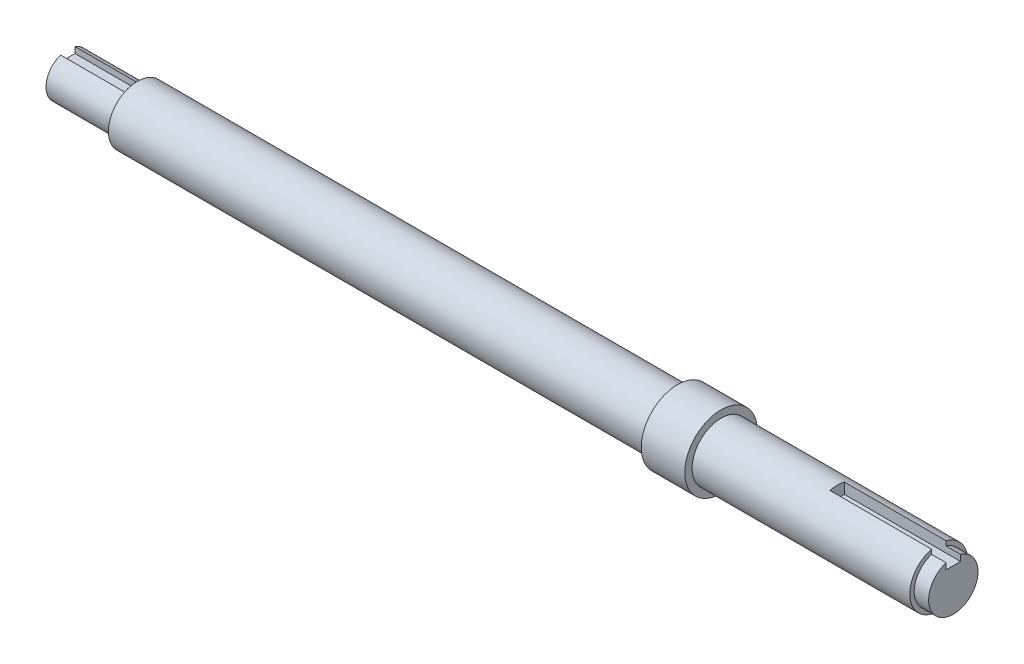
ISO-10303-21;
HEADER;
FILE_DESCRIPTION(('STEP AP214'),'2;1');
FILE_NAME('part.step','',(''),(''),'','','');
FILE_SCHEMA(('AUTOMOTIVE_DESIGN { 1 0 10303 214 1 1 1 1 }'));
ENDSEC;
DATA;
#1=APPLICATION_CONTEXT('core data for automotive mechanical design processes');
#2=APPLICATION_PROTOCOL_DEFINITION('international standard','automotive_design',2000,#1);
#3=PRODUCT_CONTEXT('',#1,'mechanical');
#4=PRODUCT('Part','Part','',(#3));
#5=PRODUCT_RELATED_PRODUCT_CATEGORY('part','',(#4));
#6=PRODUCT_DEFINITION_FORMATION('','',#4);
#7=PRODUCT_DEFINITION_CONTEXT('part definition',#1,'design');
#8=PRODUCT_DEFINITION('design','',#6,#7);
#9=PRODUCT_DEFINITION_SHAPE('','',#8);
#10=(LENGTH_UNIT() NAMED_UNIT(*) SI_UNIT(.MILLI.,.METRE.));
#11=(NAMED_UNIT(*) PLANE_ANGLE_UNIT() SI_UNIT($,.RADIAN.));
#12=(NAMED_UNIT(*) SI_UNIT($,.STERADIAN.) SOLID_ANGLE_UNIT());
#13=UNCERTAINTY_MEASURE_WITH_UNIT(LENGTH_MEASURE(1.E-05),#10,'distance_accuracy_value','');
#14=(GEOMETRIC_REPRESENTATION_CONTEXT(3) GLOBAL_UNCERTAINTY_ASSIGNED_CONTEXT((#13)) GLOBAL_UNIT_ASSIGNED_CONTEXT((#10,
#11,#12)) REPRESENTATION_CONTEXT('',''));
#15=CARTESIAN_POINT('',(0.,0.,0.));
#16=DIRECTION('',(0.,0.,1.));
#17=DIRECTION('',(1.,0.,0.));
#18=AXIS2_PLACEMENT_3D('',#15,#16,#17);
#19=CARTESIAN_POINT('',(300.,0.,0.));
#20=DIRECTION('',(-1.,0.,0.));
#21=DIRECTION('',(0.,0.,1.));
#22=AXIS2_PLACEMENT_3D('',#19,#20,#21);
#23=CYLINDRICAL_SURFACE('',#22,10.);
#24=CARTESIAN_POINT('',(24.,0.,0.));
#25=DIRECTION('',(-1.,0.,0.));
#26=DIRECTION('',(0.,0.,1.));
#27=AXIS2_PLACEMENT_3D('',#24,#25,#26);
#28=CIRCLE('',#27,10.);
#29=CARTESIAN_POINT('',(24.,0.,10.));
#30=VERTEX_POINT('',#29);
#31=EDGE_CURVE('E187',#30,#30,#28,.T.);
#32=ORIENTED_EDGE('',*,*,#31,.F.);
#33=EDGE_LOOP('',(#32));
#34=FACE_BOUND('',#33,.T.);
#35=CARTESIAN_POINT('',(210.,0.,0.));
#36=DIRECTION('',(1.,0.,0.));
#37=DIRECTION('',(0.,0.,-1.));
#38=AXIS2_PLACEMENT_3D('',#35,#36,#37);
#39=CIRCLE('',#38,10.);
#40=CARTESIAN_POINT('',(210.,0.,-10.));
#41=VERTEX_POINT('',#40);
#42=EDGE_CURVE('E11',#41,#41,#39,.T.);
#43=ORIENTED_EDGE('',*,*,#42,.F.);
#44=EDGE_LOOP('',(#43));
#45=FACE_BOUND('',#44,.T.);
#46=ADVANCED_FACE('F41',(#34,#45),#23,.T.);
#47=CARTESIAN_POINT('',(24.,0.,0.));
#48=DIRECTION('',(-1.,0.,0.));
#49=DIRECTION('',(0.,0.,1.));
#50=AXIS2_PLACEMENT_3D('',#47,#48,#49);
#51=PLANE('',#50);
#52=DIRECTION('',(0.,1.,0.));
#53=VECTOR('',#52,1.);
#54=CARTESIAN_POINT('',(24.,7.07106781186548,-2.5));
#55=LINE('',#54,#53);
#56=CARTESIAN_POINT('',(24.,5.,-2.5));
#57=VERTEX_POINT('',#56);
#58=CARTESIAN_POINT('',(24.,7.07106781186548,-2.5));
#59=VERTEX_POINT('',#58);
#60=EDGE_CURVE('E173',#57,#59,#55,.T.);
#61=ORIENTED_EDGE('',*,*,#60,.F.);
#62=DIRECTION('',(0.,0.,-1.));
#63=VECTOR('',#62,1.);
#64=CARTESIAN_POINT('',(24.,5.,-2.5));
#65=LINE('',#64,#63);
#66=CARTESIAN_POINT('',(24.,5.,2.5));
#67=VERTEX_POINT('',#66);
#68=EDGE_CURVE('E170',#67,#57,#65,.T.);
#69=ORIENTED_EDGE('',*,*,#68,.F.);
#70=DIRECTION('',(0.,-1.,0.));
#71=VECTOR('',#70,1.);
#72=CARTESIAN_POINT('',(24.,5.,2.5));
#73=LINE('',#72,#71);
#74=CARTESIAN_POINT('',(24.,7.07106781186548,2.5));
#75=VERTEX_POINT('',#74);
#76=EDGE_CURVE('E166',#75,#67,#73,.T.);
#77=ORIENTED_EDGE('',*,*,#76,.F.);
#78=CARTESIAN_POINT('',(24.,0.,0.));
#79=DIRECTION('',(-1.,0.,0.));
#80=DIRECTION('',(0.,0.,1.));
#81=AXIS2_PLACEMENT_3D('',#78,#79,#80);
#82=CIRCLE('',#81,7.5);
#83=EDGE_CURVE('E163',#59,#75,#82,.T.);
#84=ORIENTED_EDGE('',*,*,#83,.F.);
#85=EDGE_LOOP('',(#61,#69,#77,#84));
#86=FACE_BOUND('',#85,.T.);
#87=ORIENTED_EDGE('',*,*,#31,.T.);
#88=EDGE_LOOP('',(#87));
#89=FACE_BOUND('',#88,.T.);
#90=ADVANCED_FACE('F243',(#86,#89),#51,.T.);
#91=CARTESIAN_POINT('',(24.,0.,0.));
#92=DIRECTION('',(-1.,0.,0.));
#93=DIRECTION('',(0.,0.,1.));
#94=AXIS2_PLACEMENT_3D('',#91,#92,#93);
#95=CYLINDRICAL_SURFACE('',#94,7.5);
#96=CARTESIAN_POINT('',(0.,0.,0.));
#97=DIRECTION('',(-1.,0.,0.));
#98=DIRECTION('',(0.,0.,1.));
#99=AXIS2_PLACEMENT_3D('',#96,#97,#98);
#100=CIRCLE('',#99,7.5);
#101=CARTESIAN_POINT('',(0.,7.07106781186548,-2.5));
#102=VERTEX_POINT('',#101);
#103=CARTESIAN_POINT('',(0.,7.07106781186548,2.5));
#104=VERTEX_POINT('',#103);
#105=EDGE_CURVE('E162',#102,#104,#100,.T.);
#106=ORIENTED_EDGE('',*,*,#105,.F.);
#107=DIRECTION('',(-1.,0.,0.));
#108=VECTOR('',#107,1.);
#109=CARTESIAN_POINT('',(24.,7.07106781186548,-2.5));
#110=LINE('',#109,#108);
#111=EDGE_CURVE('E185',#59,#102,#110,.T.);
#112=ORIENTED_EDGE('',*,*,#111,.F.);
#113=ORIENTED_EDGE('',*,*,#83,.T.);
#114=DIRECTION('',(-1.,0.,0.));
#115=VECTOR('',#114,1.);
#116=CARTESIAN_POINT('',(24.,7.07106781186548,2.5));
#117=LINE('',#116,#115);
#118=EDGE_CURVE('E176',#75,#104,#117,.T.);
#119=ORIENTED_EDGE('',*,*,#118,.T.);
#120=EDGE_LOOP('',(#106,#112,#113,#119));
#121=FACE_BOUND('',#120,.T.);
#122=ADVANCED_FACE('F250',(#121),#95,.T.);
#123=CARTESIAN_POINT('',(24.,7.07106781186548,-2.5));
#124=DIRECTION('',(0.,0.,1.));
#125=DIRECTION('',(0.,-1.,0.));
#126=AXIS2_PLACEMENT_3D('',#123,#124,#125);
#127=PLANE('',#126);
#128=DIRECTION('',(0.,1.,0.));
#129=VECTOR('',#128,1.);
#130=CARTESIAN_POINT('',(0.,7.07106781186548,-2.5));
#131=LINE('',#130,#129);
#132=CARTESIAN_POINT('',(0.,5.,-2.5));
#133=VERTEX_POINT('',#132);
#134=EDGE_CURVE('E167',#133,#102,#131,.T.);
#135=ORIENTED_EDGE('',*,*,#134,.F.);
#136=DIRECTION('',(-1.,0.,0.));
#137=VECTOR('',#136,1.);
#138=CARTESIAN_POINT('',(24.,5.,-2.5));
#139=LINE('',#138,#137);
#140=EDGE_CURVE('E188',#57,#133,#139,.T.);
#141=ORIENTED_EDGE('',*,*,#140,.F.);
#142=ORIENTED_EDGE('',*,*,#60,.T.);
#143=ORIENTED_EDGE('',*,*,#111,.T.);
#144=EDGE_LOOP('',(#135,#141,#142,#143));
#145=FACE_BOUND('',#144,.T.);
#146=ADVANCED_FACE('F335',(#145),#127,.T.);
#147=CARTESIAN_POINT('',(24.,5.,-2.5));
#148=DIRECTION('',(0.,1.,0.));
#149=DIRECTION('',(0.,0.,1.));
#150=AXIS2_PLACEMENT_3D('',#147,#148,#149);
#151=PLANE('',#150);
#152=DIRECTION('',(0.,0.,-1.));
#153=VECTOR('',#152,1.);
#154=CARTESIAN_POINT('',(0.,5.,-2.5));
#155=LINE('',#154,#153);
#156=CARTESIAN_POINT('',(0.,5.,2.5));
#157=VERTEX_POINT('',#156);
#158=EDGE_CURVE('E64',#157,#133,#155,.T.);
#159=ORIENTED_EDGE('',*,*,#158,.F.);
#160=DIRECTION('',(-1.,0.,0.));
#161=VECTOR('',#160,1.);
#162=CARTESIAN_POINT('',(24.,5.,2.5));
#163=LINE('',#162,#161);
#164=EDGE_CURVE('E190',#67,#157,#163,.T.);
#165=ORIENTED_EDGE('',*,*,#164,.F.);
#166=ORIENTED_EDGE('',*,*,#68,.T.);
#167=ORIENTED_EDGE('',*,*,#140,.T.);
#168=EDGE_LOOP('',(#159,#165,#166,#167));
#169=FACE_BOUND('',#168,.T.);
#170=ADVANCED_FACE('F324',(#169),#151,.T.);
#171=CARTESIAN_POINT('',(24.,5.,2.5));
#172=DIRECTION('',(0.,0.,-1.));
#173=DIRECTION('',(0.,1.,0.));
#174=AXIS2_PLACEMENT_3D('',#171,#172,#173);
#175=PLANE('',#174);
#176=DIRECTION('',(0.,-1.,0.));
#177=VECTOR('',#176,1.);
#178=CARTESIAN_POINT('',(0.,5.,2.5));
#179=LINE('',#178,#177);
#180=EDGE_CURVE('E179',#104,#157,#179,.T.);
#181=ORIENTED_EDGE('',*,*,#180,.F.);
#182=ORIENTED_EDGE('',*,*,#118,.F.);
#183=ORIENTED_EDGE('',*,*,#76,.T.);
#184=ORIENTED_EDGE('',*,*,#164,.T.);
#185=EDGE_LOOP('',(#181,#182,#183,#184));
#186=FACE_BOUND('',#185,.T.);
#187=ADVANCED_FACE('F319',(#186),#175,.T.);
#188=CARTESIAN_POINT('',(0.,0.,0.));
#189=DIRECTION('',(1.,0.,0.));
#190=DIRECTION('',(0.,0.,-1.));
#191=AXIS2_PLACEMENT_3D('',#188,#189,#190);
#192=PLANE('',#191);
#193=ORIENTED_EDGE('',*,*,#105,.T.);
#194=ORIENTED_EDGE('',*,*,#180,.T.);
#195=ORIENTED_EDGE('',*,*,#158,.T.);
#196=ORIENTED_EDGE('',*,*,#134,.T.);
#197=EDGE_LOOP('',(#193,#194,#195,#196));
#198=FACE_BOUND('',#197,.T.);
#199=ADVANCED_FACE('F283',(#198),#192,.F.);
#200=CARTESIAN_POINT('',(210.,0.,0.));
#201=DIRECTION('',(1.,0.,0.));
#202=DIRECTION('',(0.,0.,-1.));
#203=AXIS2_PLACEMENT_3D('',#200,#201,#202);
#204=CYLINDRICAL_SURFACE('',#203,12.5);
#205=CARTESIAN_POINT('',(210.,0.,0.));
#206=DIRECTION('',(1.,0.,0.));
#207=DIRECTION('',(0.,0.,-1.));
#208=AXIS2_PLACEMENT_3D('',#205,#206,#207);
#209=CIRCLE('',#208,12.5);
#210=CARTESIAN_POINT('',(210.,0.,-12.5));
#211=VERTEX_POINT('',#210);
#212=EDGE_CURVE('E206',#211,#211,#209,.T.);
#213=ORIENTED_EDGE('',*,*,#212,.T.);
#214=EDGE_LOOP('',(#213));
#215=FACE_BOUND('',#214,.T.);
#216=CARTESIAN_POINT('',(225.,0.,0.));
#217=DIRECTION('',(1.,0.,0.));
#218=DIRECTION('',(0.,0.,-1.));
#219=AXIS2_PLACEMENT_3D('',#216,#217,#218);
#220=CIRCLE('',#219,12.5);
#221=CARTESIAN_POINT('',(225.,0.,-12.5));
#222=VERTEX_POINT('',#221);
#223=EDGE_CURVE('E210',#222,#222,#220,.T.);
#224=ORIENTED_EDGE('',*,*,#223,.F.);
#225=EDGE_LOOP('',(#224));
#226=FACE_BOUND('',#225,.T.);
#227=ADVANCED_FACE('F275',(#215,#226),#204,.T.);
#228=CARTESIAN_POINT('',(210.,0.,0.));
#229=DIRECTION('',(1.,0.,0.));
#230=DIRECTION('',(0.,0.,-1.));
#231=AXIS2_PLACEMENT_3D('',#228,#229,#230);
#232=PLANE('',#231);
#233=ORIENTED_EDGE('',*,*,#42,.T.);
#234=EDGE_LOOP('',(#233));
#235=FACE_BOUND('',#234,.T.);
#236=ORIENTED_EDGE('',*,*,#212,.F.);
#237=EDGE_LOOP('',(#236));
#238=FACE_BOUND('',#237,.T.);
#239=ADVANCED_FACE('F267',(#235,#238),#232,.F.);
#240=CARTESIAN_POINT('',(225.,0.,0.));
#241=DIRECTION('',(1.,0.,0.));
#242=DIRECTION('',(0.,0.,-1.));
#243=AXIS2_PLACEMENT_3D('',#240,#241,#242);
#244=PLANE('',#243);
#245=CARTESIAN_POINT('',(225.,0.,0.));
#246=DIRECTION('',(1.,0.,0.));
#247=DIRECTION('',(0.,0.,-1.));
#248=AXIS2_PLACEMENT_3D('',#245,#246,#247);
#249=CIRCLE('',#248,10.);
#250=CARTESIAN_POINT('',(225.,0.,-10.));
#251=VERTEX_POINT('',#250);
#252=EDGE_CURVE('E146',#251,#251,#249,.T.);
#253=ORIENTED_EDGE('',*,*,#252,.F.);
#254=EDGE_LOOP('',(#253));
#255=FACE_BOUND('',#254,.T.);
#256=ORIENTED_EDGE('',*,*,#223,.T.);
#257=EDGE_LOOP('',(#256));
#258=FACE_BOUND('',#257,.T.);
#259=ADVANCED_FACE('F263',(#255,#258),#244,.T.);
#260=CARTESIAN_POINT('',(305.,0.,0.));
#261=DIRECTION('',(-1.,0.,0.));
#262=DIRECTION('',(0.,0.,1.));
#263=AXIS2_PLACEMENT_3D('',#260,#261,#262);
#264=CYLINDRICAL_SURFACE('',#263,8.5);
#265=CARTESIAN_POINT('',(300.,0.,0.));
#266=DIRECTION('',(1.,0.,0.));
#267=DIRECTION('',(0.,0.,-1.));
#268=AXIS2_PLACEMENT_3D('',#265,#266,#267);
#269=CIRCLE('',#268,8.5);
#270=CARTESIAN_POINT('',(300.,8.12403840463596,2.5));
#271=VERTEX_POINT('',#270);
#272=CARTESIAN_POINT('',(300.,8.12403840463596,-2.5));
#273=VERTEX_POINT('',#272);
#274=EDGE_CURVE('E195',#271,#273,#269,.T.);
#275=ORIENTED_EDGE('',*,*,#274,.T.);
#276=DIRECTION('',(-1.,0.,0.));
#277=VECTOR('',#276,1.);
#278=CARTESIAN_POINT('',(305.,8.12403840463596,-2.5));
#279=LINE('',#278,#277);
#280=CARTESIAN_POINT('',(305.,8.12403840463596,-2.5));
#281=VERTEX_POINT('',#280);
#282=EDGE_CURVE('E154',#273,#281,#279,.F.);
#283=ORIENTED_EDGE('',*,*,#282,.T.);
#284=CARTESIAN_POINT('',(305.,0.,0.));
#285=DIRECTION('',(1.,0.,0.));
#286=DIRECTION('',(0.,0.,-1.));
#287=AXIS2_PLACEMENT_3D('',#284,#285,#286);
#288=CIRCLE('',#287,8.5);
#289=CARTESIAN_POINT('',(305.,8.12403840463596,2.5));
#290=VERTEX_POINT('',#289);
#291=EDGE_CURVE('E196',#290,#281,#288,.T.);
#292=ORIENTED_EDGE('',*,*,#291,.F.);
#293=DIRECTION('',(-1.,0.,0.));
#294=VECTOR('',#293,1.);
#295=CARTESIAN_POINT('',(305.,8.12403840463596,2.5));
#296=LINE('',#295,#294);
#297=EDGE_CURVE('E56',#290,#271,#296,.T.);
#298=ORIENTED_EDGE('',*,*,#297,.T.);
#299=EDGE_LOOP('',(#275,#283,#292,#298));
#300=FACE_BOUND('',#299,.T.);
#301=ADVANCED_FACE('F225',(#300),#264,.T.);
#302=CARTESIAN_POINT('',(305.,0.,0.));
#303=DIRECTION('',(1.,0.,0.));
#304=DIRECTION('',(0.,0.,-1.));
#305=AXIS2_PLACEMENT_3D('',#302,#303,#304);
#306=PLANE('',#305);
#307=DIRECTION('',(0.,1.,0.));
#308=VECTOR('',#307,1.);
#309=CARTESIAN_POINT('',(305.,6.,-2.5));
#310=LINE('',#309,#308);
#311=CARTESIAN_POINT('',(305.,6.,-2.5));
#312=VERTEX_POINT('',#311);
#313=EDGE_CURVE('E143',#312,#281,#310,.T.);
#314=ORIENTED_EDGE('',*,*,#313,.F.);
#315=DIRECTION('',(0.,0.,-1.));
#316=VECTOR('',#315,1.);
#317=CARTESIAN_POINT('',(305.,6.,2.5));
#318=LINE('',#317,#316);
#319=CARTESIAN_POINT('',(305.,6.,2.5));
#320=VERTEX_POINT('',#319);
#321=EDGE_CURVE('E145',#320,#312,#318,.T.);
#322=ORIENTED_EDGE('',*,*,#321,.F.);
#323=DIRECTION('',(0.,-1.,0.));
#324=VECTOR('',#323,1.);
#325=CARTESIAN_POINT('',(305.,0.,2.5));
#326=LINE('',#325,#324);
#327=EDGE_CURVE('E132',#290,#320,#326,.T.);
#328=ORIENTED_EDGE('',*,*,#327,.F.);
#329=ORIENTED_EDGE('',*,*,#291,.T.);
#330=EDGE_LOOP('',(#314,#322,#328,#329));
#331=FACE_BOUND('',#330,.T.);
#332=ADVANCED_FACE('F229',(#331),#306,.T.);
#333=CARTESIAN_POINT('',(265.,6.,2.5));
#334=DIRECTION('',(0.,-1.,0.));
#335=DIRECTION('',(0.,0.,-1.));
#336=AXIS2_PLACEMENT_3D('',#333,#334,#335);
#337=PLANE('',#336);
#338=ORIENTED_EDGE('',*,*,#321,.T.);
#339=DIRECTION('',(1.,0.,0.));
#340=VECTOR('',#339,1.);
#341=CARTESIAN_POINT('',(265.,6.,-2.5));
#342=LINE('',#341,#340);
#343=CARTESIAN_POINT('',(265.,6.,-2.5));
#344=VERTEX_POINT('',#343);
#345=EDGE_CURVE('E136',#344,#312,#342,.T.);
#346=ORIENTED_EDGE('',*,*,#345,.F.);
#347=DIRECTION('',(0.,0.,-1.));
#348=VECTOR('',#347,1.);
#349=CARTESIAN_POINT('',(265.,6.,2.5));
#350=LINE('',#349,#348);
#351=CARTESIAN_POINT('',(265.,6.,2.5));
#352=VERTEX_POINT('',#351);
#353=EDGE_CURVE('E124',#352,#344,#350,.T.);
#354=ORIENTED_EDGE('',*,*,#353,.F.);
#355=DIRECTION('',(1.,0.,0.));
#356=VECTOR('',#355,1.);
#357=CARTESIAN_POINT('',(265.,6.,2.5));
#358=LINE('',#357,#356);
#359=EDGE_CURVE('E130',#352,#320,#358,.T.);
#360=ORIENTED_EDGE('',*,*,#359,.T.);
#361=EDGE_LOOP('',(#338,#346,#354,#360));
#362=FACE_BOUND('',#361,.T.);
#363=ADVANCED_FACE('F138',(#362),#337,.F.);
#364=CARTESIAN_POINT('',(265.,6.,2.5));
#365=DIRECTION('',(0.,0.,1.));
#366=DIRECTION('',(1.,0.,0.));
#367=AXIS2_PLACEMENT_3D('',#364,#365,#366);
#368=PLANE('',#367);
#369=DIRECTION('',(0.,-1.,0.));
#370=VECTOR('',#369,1.);
#371=CARTESIAN_POINT('',(300.,0.,2.5));
#372=LINE('',#371,#370);
#373=CARTESIAN_POINT('',(300.,9.68245836551854,2.5));
#374=VERTEX_POINT('',#373);
#375=EDGE_CURVE('E150',#374,#271,#372,.T.);
#376=ORIENTED_EDGE('',*,*,#375,.T.);
#377=ORIENTED_EDGE('',*,*,#297,.F.);
#378=ORIENTED_EDGE('',*,*,#327,.T.);
#379=ORIENTED_EDGE('',*,*,#359,.F.);
#380=DIRECTION('',(0.,-1.,0.));
#381=VECTOR('',#380,1.);
#382=CARTESIAN_POINT('',(265.,6.,2.5));
#383=LINE('',#382,#381);
#384=CARTESIAN_POINT('',(265.,9.68245836551854,2.5));
#385=VERTEX_POINT('',#384);
#386=EDGE_CURVE('E119',#385,#352,#383,.T.);
#387=ORIENTED_EDGE('',*,*,#386,.F.);
#388=DIRECTION('',(-1.,0.,0.));
#389=VECTOR('',#388,1.);
#390=CARTESIAN_POINT('',(300.,9.68245836551854,2.5));
#391=LINE('',#390,#389);
#392=EDGE_CURVE('E152',#374,#385,#391,.T.);
#393=ORIENTED_EDGE('',*,*,#392,.F.);
#394=EDGE_LOOP('',(#376,#377,#378,#379,#387,#393));
#395=FACE_BOUND('',#394,.T.);
#396=ADVANCED_FACE('F131',(#395),#368,.F.);
#397=CARTESIAN_POINT('',(300.,0.,0.));
#398=DIRECTION('',(1.,0.,0.));
#399=DIRECTION('',(0.,0.,-1.));
#400=AXIS2_PLACEMENT_3D('',#397,#398,#399);
#401=PLANE('',#400);
#402=DIRECTION('',(0.,1.,0.));
#403=VECTOR('',#402,1.);
#404=CARTESIAN_POINT('',(300.,0.,-2.5));
#405=LINE('',#404,#403);
#406=CARTESIAN_POINT('',(300.,9.68245836551854,-2.5));
#407=VERTEX_POINT('',#406);
#408=EDGE_CURVE('E157',#273,#407,#405,.T.);
#409=ORIENTED_EDGE('',*,*,#408,.F.);
#410=ORIENTED_EDGE('',*,*,#274,.F.);
#411=ORIENTED_EDGE('',*,*,#375,.F.);
#412=CARTESIAN_POINT('',(300.,0.,0.));
#413=DIRECTION('',(1.,0.,0.));
#414=DIRECTION('',(0.,0.,-1.));
#415=AXIS2_PLACEMENT_3D('',#412,#413,#414);
#416=CIRCLE('',#415,10.);
#417=EDGE_CURVE('E199',#374,#407,#416,.T.);
#418=ORIENTED_EDGE('',*,*,#417,.T.);
#419=EDGE_LOOP('',(#409,#410,#411,#418));
#420=FACE_BOUND('',#419,.T.);
#421=ADVANCED_FACE('F223',(#420),#401,.T.);
#422=CARTESIAN_POINT('',(265.,6.,-2.5));
#423=DIRECTION('',(0.,0.,-1.));
#424=DIRECTION('',(-1.,0.,0.));
#425=AXIS2_PLACEMENT_3D('',#422,#423,#424);
#426=PLANE('',#425);
#427=DIRECTION('',(0.,1.,0.));
#428=VECTOR('',#427,1.);
#429=CARTESIAN_POINT('',(265.,6.,-2.5));
#430=LINE('',#429,#428);
#431=CARTESIAN_POINT('',(265.,9.68245836551854,-2.5));
#432=VERTEX_POINT('',#431);
#433=EDGE_CURVE('E127',#344,#432,#430,.T.);
#434=ORIENTED_EDGE('',*,*,#433,.F.);
#435=ORIENTED_EDGE('',*,*,#345,.T.);
#436=ORIENTED_EDGE('',*,*,#313,.T.);
#437=ORIENTED_EDGE('',*,*,#282,.F.);
#438=ORIENTED_EDGE('',*,*,#408,.T.);
#439=DIRECTION('',(-1.,0.,0.));
#440=VECTOR('',#439,1.);
#441=CARTESIAN_POINT('',(300.,9.68245836551854,-2.5));
#442=LINE('',#441,#440);
#443=EDGE_CURVE('E159',#432,#407,#442,.F.);
#444=ORIENTED_EDGE('',*,*,#443,.F.);
#445=EDGE_LOOP('',(#434,#435,#436,#437,#438,#444));
#446=FACE_BOUND('',#445,.T.);
#447=ADVANCED_FACE('F230',(#446),#426,.F.);
#448=CARTESIAN_POINT('',(265.,0.,0.));
#449=DIRECTION('',(-1.,0.,0.));
#450=DIRECTION('',(0.,0.,1.));
#451=AXIS2_PLACEMENT_3D('',#448,#449,#450);
#452=PLANE('',#451);
#453=ORIENTED_EDGE('',*,*,#386,.T.);
#454=ORIENTED_EDGE('',*,*,#353,.T.);
#455=ORIENTED_EDGE('',*,*,#433,.T.);
#456=CARTESIAN_POINT('',(265.,0.,0.));
#457=DIRECTION('',(-1.,0.,0.));
#458=DIRECTION('',(0.,0.,1.));
#459=AXIS2_PLACEMENT_3D('',#456,#457,#458);
#460=CIRCLE('',#459,10.);
#461=EDGE_CURVE('E49',#385,#432,#460,.T.);
#462=ORIENTED_EDGE('',*,*,#461,.F.);
#463=EDGE_LOOP('',(#453,#454,#455,#462));
#464=FACE_BOUND('',#463,.T.);
#465=ADVANCED_FACE('F121',(#464),#452,.F.);
#466=ORIENTED_EDGE('',*,*,#252,.T.);
#467=EDGE_LOOP('',(#466));
#468=FACE_BOUND('',#467,.T.);
#469=ORIENTED_EDGE('',*,*,#461,.T.);
#470=ORIENTED_EDGE('',*,*,#443,.T.);
#471=ORIENTED_EDGE('',*,*,#417,.F.);
#472=ORIENTED_EDGE('',*,*,#392,.T.);
#473=EDGE_LOOP('',(#469,#470,#471,#472));
#474=FACE_BOUND('',#473,.T.);
#475=ADVANCED_FACE('F43',(#468,#474),#23,.T.);
#476=CLOSED_SHELL('',(#46,#90,#122,#146,#170,#187,#199,#227,#239,#259,#301,#332,#363,#396,#421,
#447,#465,#475));
#477=MANIFOLD_SOLID_BREP('B2',#476);
#478=ADVANCED_BREP_SHAPE_REPRESENTATION('',(#18,#477),#14);
#479=SHAPE_DEFINITION_REPRESENTATION(#9,#478);
ENDSEC;
END-ISO-10303-21;
